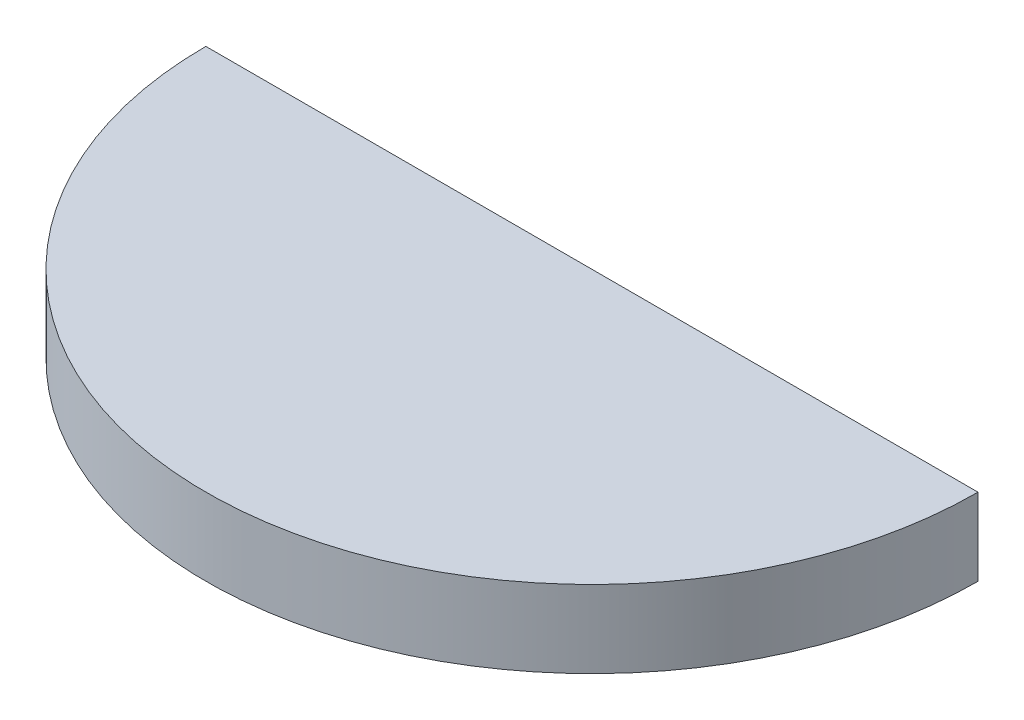
ISO-10303-21;
HEADER;
FILE_DESCRIPTION(('STEP AP214'),'2;1');
FILE_NAME('part.step','',(''),(''),'','','');
FILE_SCHEMA(('AUTOMOTIVE_DESIGN { 1 0 10303 214 1 1 1 1 }'));
ENDSEC;
DATA;
#1=APPLICATION_CONTEXT('core data for automotive mechanical design processes');
#2=APPLICATION_PROTOCOL_DEFINITION('international standard','automotive_design',2000,#1);
#3=PRODUCT_CONTEXT('',#1,'mechanical');
#4=PRODUCT('Part','Part','',(#3));
#5=PRODUCT_RELATED_PRODUCT_CATEGORY('part','',(#4));
#6=PRODUCT_DEFINITION_FORMATION('','',#4);
#7=PRODUCT_DEFINITION_CONTEXT('part definition',#1,'design');
#8=PRODUCT_DEFINITION('design','',#6,#7);
#9=PRODUCT_DEFINITION_SHAPE('','',#8);
#10=(LENGTH_UNIT() NAMED_UNIT(*) SI_UNIT(.MILLI.,.METRE.));
#11=(NAMED_UNIT(*) PLANE_ANGLE_UNIT() SI_UNIT($,.RADIAN.));
#12=(NAMED_UNIT(*) SI_UNIT($,.STERADIAN.) SOLID_ANGLE_UNIT());
#13=UNCERTAINTY_MEASURE_WITH_UNIT(LENGTH_MEASURE(1.E-05),#10,'distance_accuracy_value','');
#14=(GEOMETRIC_REPRESENTATION_CONTEXT(3) GLOBAL_UNCERTAINTY_ASSIGNED_CONTEXT((#13)) GLOBAL_UNIT_ASSIGNED_CONTEXT((#10,
#11,#12)) REPRESENTATION_CONTEXT('',''));
#15=CARTESIAN_POINT('',(0.,0.,0.));
#16=DIRECTION('',(0.,0.,1.));
#17=DIRECTION('',(1.,0.,0.));
#18=AXIS2_PLACEMENT_3D('',#15,#16,#17);
#19=CARTESIAN_POINT('',(-58.3130040874101,-32.7472974390858,26.1374810721039));
#20=DIRECTION('',(0.,1.,0.));
#21=DIRECTION('',(0.,0.,1.));
#22=AXIS2_PLACEMENT_3D('',#19,#20,#21);
#23=PLANE('',#22);
#24=DIRECTION('',(1.,0.,0.));
#25=VECTOR('',#24,1.);
#26=CARTESIAN_POINT('',(59.1914661779905,-32.7472974390858,-29.7525439278961));
#27=LINE('',#26,#25);
#28=CARTESIAN_POINT('',(-50.0285338220095,-32.7472974390858,-29.7525439278961));
#29=VERTEX_POINT('',#28);
#30=CARTESIAN_POINT('',(56.6514661779904,-32.7472974390858,-29.7525439278961));
#31=VERTEX_POINT('',#30);
#32=EDGE_CURVE('E64',#29,#31,#27,.T.);
#33=ORIENTED_EDGE('',*,*,#32,.T.);
#34=CARTESIAN_POINT('',(3.31146617799043,-32.7472974390858,-29.7525439278961));
#35=DIRECTION('',(0.,1.,0.));
#36=DIRECTION('',(0.,0.,1.));
#37=AXIS2_PLACEMENT_3D('',#34,#35,#36);
#38=CIRCLE('',#37,53.34);
#39=EDGE_CURVE('E48',#31,#29,#38,.F.);
#40=ORIENTED_EDGE('',*,*,#39,.T.);
#41=EDGE_LOOP('',(#33,#40));
#42=FACE_BOUND('',#41,.T.);
#43=ADVANCED_FACE('F34',(#42),#23,.F.);
#44=CARTESIAN_POINT('',(59.1914661779905,-43.9359974390858,-29.7525439278961));
#45=DIRECTION('',(0.,0.,-1.));
#46=DIRECTION('',(-1.,0.,0.));
#47=AXIS2_PLACEMENT_3D('',#44,#45,#46);
#48=PLANE('',#47);
#49=DIRECTION('',(0.,-1.,0.));
#50=VECTOR('',#49,1.);
#51=CARTESIAN_POINT('',(-50.0285338220095,-21.7109974390858,-29.7525439278961));
#52=LINE('',#51,#50);
#53=CARTESIAN_POINT('',(-50.0285338220095,-22.0792974390858,-29.7525439278961));
#54=VERTEX_POINT('',#53);
#55=EDGE_CURVE('E11',#54,#29,#52,.T.);
#56=ORIENTED_EDGE('',*,*,#55,.F.);
#57=DIRECTION('',(1.,0.,0.));
#58=VECTOR('',#57,1.);
#59=CARTESIAN_POINT('',(59.1914661779905,-22.0792974390858,-29.7525439278961));
#60=LINE('',#59,#58);
#61=CARTESIAN_POINT('',(56.6514661779904,-22.0792974390858,-29.7525439278961));
#62=VERTEX_POINT('',#61);
#63=EDGE_CURVE('E63',#54,#62,#60,.T.);
#64=ORIENTED_EDGE('',*,*,#63,.T.);
#65=DIRECTION('',(0.,-1.,0.));
#66=VECTOR('',#65,1.);
#67=CARTESIAN_POINT('',(56.6514661779904,-21.7109974390858,-29.7525439278961));
#68=LINE('',#67,#66);
#69=EDGE_CURVE('E38',#62,#31,#68,.T.);
#70=ORIENTED_EDGE('',*,*,#69,.T.);
#71=ORIENTED_EDGE('',*,*,#32,.F.);
#72=EDGE_LOOP('',(#56,#64,#70,#71));
#73=FACE_BOUND('',#72,.T.);
#74=ADVANCED_FACE('F60',(#73),#48,.T.);
#75=CARTESIAN_POINT('',(3.31146617799043,-21.7109974390858,-29.7525439278961));
#76=DIRECTION('',(0.,-1.,0.));
#77=DIRECTION('',(0.,0.,-1.));
#78=AXIS2_PLACEMENT_3D('',#75,#76,#77);
#79=CYLINDRICAL_SURFACE('',#78,53.34);
#80=ORIENTED_EDGE('',*,*,#69,.F.);
#81=CARTESIAN_POINT('',(3.31146617799043,-22.0792974390858,-29.7525439278961));
#82=DIRECTION('',(0.,1.,0.));
#83=DIRECTION('',(0.,0.,1.));
#84=AXIS2_PLACEMENT_3D('',#81,#82,#83);
#85=CIRCLE('',#84,53.34);
#86=EDGE_CURVE('E66',#62,#54,#85,.F.);
#87=ORIENTED_EDGE('',*,*,#86,.T.);
#88=ORIENTED_EDGE('',*,*,#55,.T.);
#89=ORIENTED_EDGE('',*,*,#39,.F.);
#90=EDGE_LOOP('',(#80,#87,#88,#89));
#91=FACE_BOUND('',#90,.T.);
#92=ADVANCED_FACE('F36',(#91),#79,.T.);
#93=CARTESIAN_POINT('',(-58.31300408741,-22.0792974390858,26.1374810721039));
#94=DIRECTION('',(0.,1.,0.));
#95=DIRECTION('',(0.,0.,1.));
#96=AXIS2_PLACEMENT_3D('',#93,#94,#95);
#97=PLANE('',#96);
#98=ORIENTED_EDGE('',*,*,#63,.F.);
#99=ORIENTED_EDGE('',*,*,#86,.F.);
#100=EDGE_LOOP('',(#98,#99));
#101=FACE_BOUND('',#100,.T.);
#102=ADVANCED_FACE('F69',(#101),#97,.T.);
#103=CLOSED_SHELL('',(#43,#74,#92,#102));
#104=MANIFOLD_SOLID_BREP('B2',#103);
#105=ADVANCED_BREP_SHAPE_REPRESENTATION('',(#18,#104),#14);
#106=SHAPE_DEFINITION_REPRESENTATION(#9,#105);
ENDSEC;
END-ISO-10303-21;
